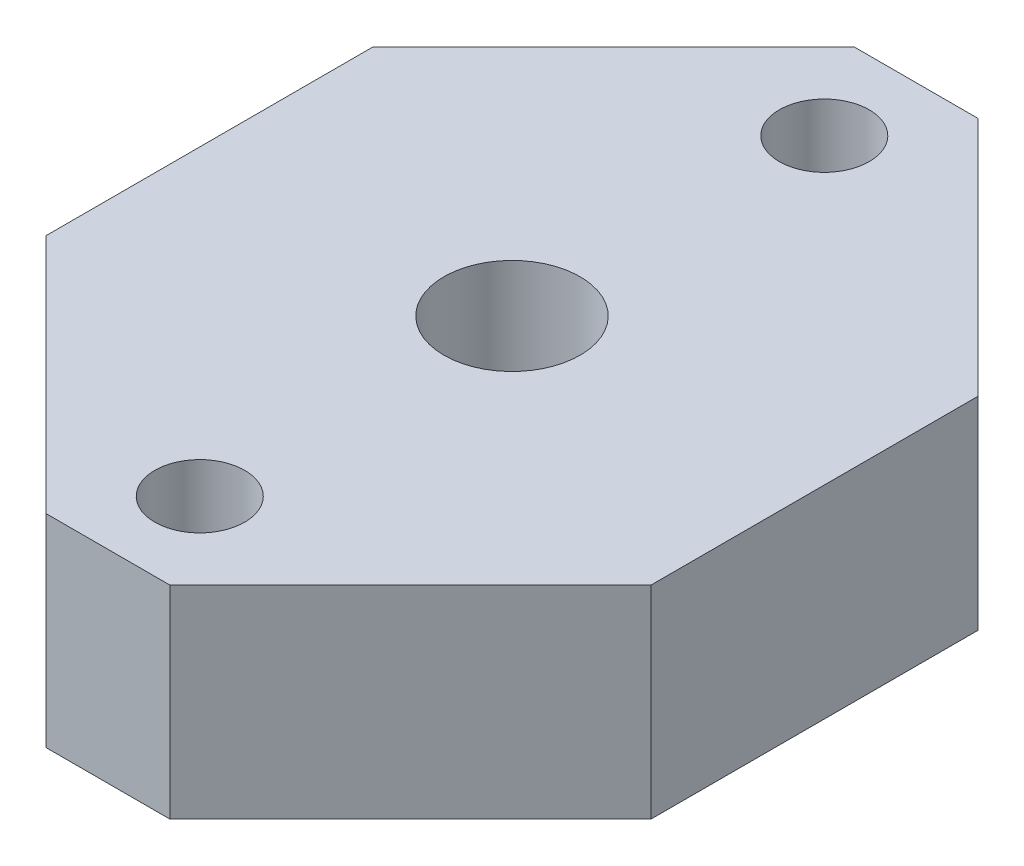
ISO-10303-21;
HEADER;
FILE_DESCRIPTION(('STEP AP214'),'2;1');
FILE_NAME('part.step','',(''),(''),'','','');
FILE_SCHEMA(('AUTOMOTIVE_DESIGN { 1 0 10303 214 1 1 1 1 }'));
ENDSEC;
DATA;
#1=APPLICATION_CONTEXT('core data for automotive mechanical design processes');
#2=APPLICATION_PROTOCOL_DEFINITION('international standard','automotive_design',2000,#1);
#3=PRODUCT_CONTEXT('',#1,'mechanical');
#4=PRODUCT('Part','Part','',(#3));
#5=PRODUCT_RELATED_PRODUCT_CATEGORY('part','',(#4));
#6=PRODUCT_DEFINITION_FORMATION('','',#4);
#7=PRODUCT_DEFINITION_CONTEXT('part definition',#1,'design');
#8=PRODUCT_DEFINITION('design','',#6,#7);
#9=PRODUCT_DEFINITION_SHAPE('','',#8);
#10=(LENGTH_UNIT() NAMED_UNIT(*) SI_UNIT(.MILLI.,.METRE.));
#11=(NAMED_UNIT(*) PLANE_ANGLE_UNIT() SI_UNIT($,.RADIAN.));
#12=(NAMED_UNIT(*) SI_UNIT($,.STERADIAN.) SOLID_ANGLE_UNIT());
#13=UNCERTAINTY_MEASURE_WITH_UNIT(LENGTH_MEASURE(1.E-05),#10,'distance_accuracy_value','');
#14=(GEOMETRIC_REPRESENTATION_CONTEXT(3) GLOBAL_UNCERTAINTY_ASSIGNED_CONTEXT((#13)) GLOBAL_UNIT_ASSIGNED_CONTEXT((#10,
#11,#12)) REPRESENTATION_CONTEXT('',''));
#15=CARTESIAN_POINT('',(0.,0.,0.));
#16=DIRECTION('',(0.,0.,1.));
#17=DIRECTION('',(1.,0.,0.));
#18=AXIS2_PLACEMENT_3D('',#15,#16,#17);
#19=CARTESIAN_POINT('',(0.,11.9126,0.));
#20=DIRECTION('',(0.,1.,0.));
#21=DIRECTION('',(0.,0.,1.));
#22=AXIS2_PLACEMENT_3D('',#19,#20,#21);
#23=PLANE('',#22);
#24=DIRECTION('',(0.707106781186548,0.,-0.707106781186548));
#25=VECTOR('',#24,1.);
#26=CARTESIAN_POINT('',(14.1421356237309,11.9126,-47.498));
#27=LINE('',#26,#25);
#28=CARTESIAN_POINT('',(0.,11.9126,-33.3558643762691));
#29=VERTEX_POINT('',#28);
#30=CARTESIAN_POINT('',(14.1421356237309,11.9126,-47.498));
#31=VERTEX_POINT('',#30);
#32=EDGE_CURVE('E165',#29,#31,#27,.T.);
#33=ORIENTED_EDGE('',*,*,#32,.F.);
#34=DIRECTION('',(0.,0.,1.));
#35=VECTOR('',#34,1.);
#36=CARTESIAN_POINT('',(0.,11.9126,-47.498));
#37=LINE('',#36,#35);
#38=CARTESIAN_POINT('',(0.,11.9126,-14.1421356237309));
#39=VERTEX_POINT('',#38);
#40=EDGE_CURVE('E132',#29,#39,#37,.T.);
#41=ORIENTED_EDGE('',*,*,#40,.T.);
#42=DIRECTION('',(-0.707106781186548,0.,-0.707106781186548));
#43=VECTOR('',#42,1.);
#44=CARTESIAN_POINT('',(14.1421356237309,11.9126,0.));
#45=LINE('',#44,#43);
#46=CARTESIAN_POINT('',(14.1421356237309,11.9126,0.));
#47=VERTEX_POINT('',#46);
#48=EDGE_CURVE('E106',#47,#39,#45,.T.);
#49=ORIENTED_EDGE('',*,*,#48,.F.);
#50=DIRECTION('',(1.,0.,0.));
#51=VECTOR('',#50,1.);
#52=CARTESIAN_POINT('',(0.,11.9126,0.));
#53=LINE('',#52,#51);
#54=CARTESIAN_POINT('',(21.4178643762691,11.9126,0.));
#55=VERTEX_POINT('',#54);
#56=EDGE_CURVE('E130',#47,#55,#53,.T.);
#57=ORIENTED_EDGE('',*,*,#56,.T.);
#58=DIRECTION('',(-0.707106781186547,0.,0.707106781186548));
#59=VECTOR('',#58,1.);
#60=CARTESIAN_POINT('',(21.4178643762691,11.9126,0.));
#61=LINE('',#60,#59);
#62=CARTESIAN_POINT('',(35.56,11.9126,-14.1421356237309));
#63=VERTEX_POINT('',#62);
#64=EDGE_CURVE('E101',#63,#55,#61,.T.);
#65=ORIENTED_EDGE('',*,*,#64,.F.);
#66=DIRECTION('',(0.,0.,-1.));
#67=VECTOR('',#66,1.);
#68=CARTESIAN_POINT('',(35.56,11.9126,-47.498));
#69=LINE('',#68,#67);
#70=CARTESIAN_POINT('',(35.56,11.9126,-33.3558643762691));
#71=VERTEX_POINT('',#70);
#72=EDGE_CURVE('E42',#63,#71,#69,.T.);
#73=ORIENTED_EDGE('',*,*,#72,.T.);
#74=DIRECTION('',(0.707106781186547,0.,0.707106781186548));
#75=VECTOR('',#74,1.);
#76=CARTESIAN_POINT('',(35.56,11.9126,-33.3558643762691));
#77=LINE('',#76,#75);
#78=CARTESIAN_POINT('',(21.4178643762691,11.9126,-47.498));
#79=VERTEX_POINT('',#78);
#80=EDGE_CURVE('E164',#79,#71,#77,.T.);
#81=ORIENTED_EDGE('',*,*,#80,.F.);
#82=DIRECTION('',(-1.,0.,0.));
#83=VECTOR('',#82,1.);
#84=CARTESIAN_POINT('',(0.,11.9126,-47.498));
#85=LINE('',#84,#83);
#86=EDGE_CURVE('E11',#79,#31,#85,.T.);
#87=ORIENTED_EDGE('',*,*,#86,.T.);
#88=EDGE_LOOP('',(#33,#41,#49,#57,#65,#73,#81,#87));
#89=FACE_BOUND('',#88,.T.);
#90=CARTESIAN_POINT('',(17.78,11.9126,-5.3975));
#91=DIRECTION('',(0.,1.,0.));
#92=DIRECTION('',(0.,0.,1.));
#93=AXIS2_PLACEMENT_3D('',#90,#91,#92);
#94=CIRCLE('',#93,2.6416);
#95=CARTESIAN_POINT('',(17.78,11.9126,-2.7559));
#96=VERTEX_POINT('',#95);
#97=EDGE_CURVE('E138',#96,#96,#94,.T.);
#98=ORIENTED_EDGE('',*,*,#97,.F.);
#99=EDGE_LOOP('',(#98));
#100=FACE_BOUND('',#99,.T.);
#101=CARTESIAN_POINT('',(17.78,11.9126,-42.1005));
#102=DIRECTION('',(0.,1.,0.));
#103=DIRECTION('',(0.,0.,1.));
#104=AXIS2_PLACEMENT_3D('',#101,#102,#103);
#105=CIRCLE('',#104,2.6416);
#106=CARTESIAN_POINT('',(17.78,11.9126,-39.4589));
#107=VERTEX_POINT('',#106);
#108=EDGE_CURVE('E125',#107,#107,#105,.T.);
#109=ORIENTED_EDGE('',*,*,#108,.F.);
#110=EDGE_LOOP('',(#109));
#111=FACE_BOUND('',#110,.T.);
#112=CARTESIAN_POINT('',(17.78,11.9126,-23.749));
#113=DIRECTION('',(0.,1.,0.));
#114=DIRECTION('',(0.,0.,1.));
#115=AXIS2_PLACEMENT_3D('',#112,#113,#114);
#116=CIRCLE('',#115,4.);
#117=CARTESIAN_POINT('',(17.78,11.9126,-19.749));
#118=VERTEX_POINT('',#117);
#119=EDGE_CURVE('E144',#118,#118,#116,.T.);
#120=ORIENTED_EDGE('',*,*,#119,.F.);
#121=EDGE_LOOP('',(#120));
#122=FACE_BOUND('',#121,.T.);
#123=ADVANCED_FACE('F33',(#89,#100,#111,#122),#23,.T.);
#124=CARTESIAN_POINT('',(0.,0.,0.));
#125=DIRECTION('',(0.,1.,0.));
#126=DIRECTION('',(0.,0.,1.));
#127=AXIS2_PLACEMENT_3D('',#124,#125,#126);
#128=PLANE('',#127);
#129=DIRECTION('',(0.,0.,1.));
#130=VECTOR('',#129,1.);
#131=CARTESIAN_POINT('',(0.,0.,-47.498));
#132=LINE('',#131,#130);
#133=CARTESIAN_POINT('',(0.,0.,-33.3558643762691));
#134=VERTEX_POINT('',#133);
#135=CARTESIAN_POINT('',(0.,0.,-14.1421356237309));
#136=VERTEX_POINT('',#135);
#137=EDGE_CURVE('E122',#134,#136,#132,.T.);
#138=ORIENTED_EDGE('',*,*,#137,.F.);
#139=DIRECTION('',(0.707106781186548,0.,-0.707106781186548));
#140=VECTOR('',#139,1.);
#141=CARTESIAN_POINT('',(14.1421356237309,0.,-47.498));
#142=LINE('',#141,#140);
#143=CARTESIAN_POINT('',(14.1421356237309,0.,-47.498));
#144=VERTEX_POINT('',#143);
#145=EDGE_CURVE('E161',#134,#144,#142,.T.);
#146=ORIENTED_EDGE('',*,*,#145,.T.);
#147=DIRECTION('',(-1.,0.,0.));
#148=VECTOR('',#147,1.);
#149=CARTESIAN_POINT('',(0.,0.,-47.498));
#150=LINE('',#149,#148);
#151=CARTESIAN_POINT('',(21.417864376269,0.,-47.498));
#152=VERTEX_POINT('',#151);
#153=EDGE_CURVE('E37',#152,#144,#150,.T.);
#154=ORIENTED_EDGE('',*,*,#153,.F.);
#155=DIRECTION('',(0.707106781186547,0.,0.707106781186548));
#156=VECTOR('',#155,1.);
#157=CARTESIAN_POINT('',(35.56,0.,-33.3558643762691));
#158=LINE('',#157,#156);
#159=CARTESIAN_POINT('',(35.56,0.,-33.3558643762691));
#160=VERTEX_POINT('',#159);
#161=EDGE_CURVE('E173',#152,#160,#158,.T.);
#162=ORIENTED_EDGE('',*,*,#161,.T.);
#163=DIRECTION('',(0.,0.,-1.));
#164=VECTOR('',#163,1.);
#165=CARTESIAN_POINT('',(35.56,0.,-47.498));
#166=LINE('',#165,#164);
#167=CARTESIAN_POINT('',(35.56,0.,-14.1421356237309));
#168=VERTEX_POINT('',#167);
#169=EDGE_CURVE('E118',#168,#160,#166,.T.);
#170=ORIENTED_EDGE('',*,*,#169,.F.);
#171=DIRECTION('',(-0.707106781186547,0.,0.707106781186548));
#172=VECTOR('',#171,1.);
#173=CARTESIAN_POINT('',(21.4178643762691,0.,0.));
#174=LINE('',#173,#172);
#175=CARTESIAN_POINT('',(21.4178643762691,0.,0.));
#176=VERTEX_POINT('',#175);
#177=EDGE_CURVE('E58',#168,#176,#174,.T.);
#178=ORIENTED_EDGE('',*,*,#177,.T.);
#179=DIRECTION('',(1.,0.,0.));
#180=VECTOR('',#179,1.);
#181=CARTESIAN_POINT('',(0.,0.,0.));
#182=LINE('',#181,#180);
#183=CARTESIAN_POINT('',(14.1421356237309,0.,0.));
#184=VERTEX_POINT('',#183);
#185=EDGE_CURVE('E115',#184,#176,#182,.T.);
#186=ORIENTED_EDGE('',*,*,#185,.F.);
#187=DIRECTION('',(-0.707106781186548,0.,-0.707106781186548));
#188=VECTOR('',#187,1.);
#189=CARTESIAN_POINT('',(14.1421356237309,0.,0.));
#190=LINE('',#189,#188);
#191=EDGE_CURVE('E50',#184,#136,#190,.T.);
#192=ORIENTED_EDGE('',*,*,#191,.T.);
#193=EDGE_LOOP('',(#138,#146,#154,#162,#170,#178,#186,#192));
#194=FACE_BOUND('',#193,.T.);
#195=CARTESIAN_POINT('',(17.78,0.,-42.1005));
#196=DIRECTION('',(0.,1.,0.));
#197=DIRECTION('',(0.,0.,1.));
#198=AXIS2_PLACEMENT_3D('',#195,#196,#197);
#199=CIRCLE('',#198,2.6416);
#200=CARTESIAN_POINT('',(17.78,0.,-39.4589));
#201=VERTEX_POINT('',#200);
#202=EDGE_CURVE('E135',#201,#201,#199,.T.);
#203=ORIENTED_EDGE('',*,*,#202,.T.);
#204=EDGE_LOOP('',(#203));
#205=FACE_BOUND('',#204,.T.);
#206=CARTESIAN_POINT('',(17.78,0.,-5.3975));
#207=DIRECTION('',(0.,1.,0.));
#208=DIRECTION('',(0.,0.,1.));
#209=AXIS2_PLACEMENT_3D('',#206,#207,#208);
#210=CIRCLE('',#209,2.6416);
#211=CARTESIAN_POINT('',(17.78,0.,-2.7559));
#212=VERTEX_POINT('',#211);
#213=EDGE_CURVE('E141',#212,#212,#210,.T.);
#214=ORIENTED_EDGE('',*,*,#213,.T.);
#215=EDGE_LOOP('',(#214));
#216=FACE_BOUND('',#215,.T.);
#217=CARTESIAN_POINT('',(17.78,0.,-23.749));
#218=DIRECTION('',(0.,1.,0.));
#219=DIRECTION('',(0.,0.,1.));
#220=AXIS2_PLACEMENT_3D('',#217,#218,#219);
#221=CIRCLE('',#220,4.);
#222=CARTESIAN_POINT('',(17.78,0.,-19.749));
#223=VERTEX_POINT('',#222);
#224=EDGE_CURVE('E147',#223,#223,#221,.T.);
#225=ORIENTED_EDGE('',*,*,#224,.T.);
#226=EDGE_LOOP('',(#225));
#227=FACE_BOUND('',#226,.T.);
#228=ADVANCED_FACE('F113',(#194,#205,#216,#227),#128,.F.);
#229=CARTESIAN_POINT('',(0.,11.9126,-47.498));
#230=DIRECTION('',(1.,0.,0.));
#231=DIRECTION('',(0.,0.,-1.));
#232=AXIS2_PLACEMENT_3D('',#229,#230,#231);
#233=PLANE('',#232);
#234=ORIENTED_EDGE('',*,*,#40,.F.);
#235=DIRECTION('',(0.,1.,0.));
#236=VECTOR('',#235,1.);
#237=CARTESIAN_POINT('',(0.,0.,-33.3558643762691));
#238=LINE('',#237,#236);
#239=EDGE_CURVE('E158',#134,#29,#238,.T.);
#240=ORIENTED_EDGE('',*,*,#239,.F.);
#241=ORIENTED_EDGE('',*,*,#137,.T.);
#242=DIRECTION('',(0.,1.,0.));
#243=VECTOR('',#242,1.);
#244=CARTESIAN_POINT('',(0.,0.,-14.1421356237309));
#245=LINE('',#244,#243);
#246=EDGE_CURVE('E150',#136,#39,#245,.T.);
#247=ORIENTED_EDGE('',*,*,#246,.T.);
#248=EDGE_LOOP('',(#234,#240,#241,#247));
#249=FACE_BOUND('',#248,.T.);
#250=ADVANCED_FACE('F35',(#249),#233,.F.);
#251=CARTESIAN_POINT('',(0.,11.9126,0.));
#252=DIRECTION('',(0.,0.,-1.));
#253=DIRECTION('',(-1.,0.,0.));
#254=AXIS2_PLACEMENT_3D('',#251,#252,#253);
#255=PLANE('',#254);
#256=ORIENTED_EDGE('',*,*,#185,.T.);
#257=DIRECTION('',(0.,1.,0.));
#258=VECTOR('',#257,1.);
#259=CARTESIAN_POINT('',(21.4178643762691,0.,0.));
#260=LINE('',#259,#258);
#261=EDGE_CURVE('E98',#176,#55,#260,.T.);
#262=ORIENTED_EDGE('',*,*,#261,.T.);
#263=ORIENTED_EDGE('',*,*,#56,.F.);
#264=DIRECTION('',(0.,1.,0.));
#265=VECTOR('',#264,1.);
#266=CARTESIAN_POINT('',(14.1421356237309,0.,0.));
#267=LINE('',#266,#265);
#268=EDGE_CURVE('E121',#184,#47,#267,.T.);
#269=ORIENTED_EDGE('',*,*,#268,.F.);
#270=EDGE_LOOP('',(#256,#262,#263,#269));
#271=FACE_BOUND('',#270,.T.);
#272=ADVANCED_FACE('F120',(#271),#255,.F.);
#273=CARTESIAN_POINT('',(35.56,11.9126,-47.498));
#274=DIRECTION('',(-1.,0.,0.));
#275=DIRECTION('',(0.,0.,1.));
#276=AXIS2_PLACEMENT_3D('',#273,#274,#275);
#277=PLANE('',#276);
#278=ORIENTED_EDGE('',*,*,#169,.T.);
#279=DIRECTION('',(0.,1.,0.));
#280=VECTOR('',#279,1.);
#281=CARTESIAN_POINT('',(35.56,0.,-33.3558643762691));
#282=LINE('',#281,#280);
#283=EDGE_CURVE('E169',#160,#71,#282,.T.);
#284=ORIENTED_EDGE('',*,*,#283,.T.);
#285=ORIENTED_EDGE('',*,*,#72,.F.);
#286=DIRECTION('',(0.,1.,0.));
#287=VECTOR('',#286,1.);
#288=CARTESIAN_POINT('',(35.56,0.,-14.1421356237309));
#289=LINE('',#288,#287);
#290=EDGE_CURVE('E107',#168,#63,#289,.T.);
#291=ORIENTED_EDGE('',*,*,#290,.F.);
#292=EDGE_LOOP('',(#278,#284,#285,#291));
#293=FACE_BOUND('',#292,.T.);
#294=ADVANCED_FACE('F185',(#293),#277,.F.);
#295=CARTESIAN_POINT('',(0.,11.9126,-47.498));
#296=DIRECTION('',(0.,0.,1.));
#297=DIRECTION('',(1.,0.,0.));
#298=AXIS2_PLACEMENT_3D('',#295,#296,#297);
#299=PLANE('',#298);
#300=ORIENTED_EDGE('',*,*,#153,.T.);
#301=DIRECTION('',(0.,1.,0.));
#302=VECTOR('',#301,1.);
#303=CARTESIAN_POINT('',(14.1421356237309,0.,-47.498));
#304=LINE('',#303,#302);
#305=EDGE_CURVE('E160',#144,#31,#304,.T.);
#306=ORIENTED_EDGE('',*,*,#305,.T.);
#307=ORIENTED_EDGE('',*,*,#86,.F.);
#308=DIRECTION('',(0.,1.,0.));
#309=VECTOR('',#308,1.);
#310=CARTESIAN_POINT('',(21.4178643762691,0.,-47.498));
#311=LINE('',#310,#309);
#312=EDGE_CURVE('E172',#152,#79,#311,.T.);
#313=ORIENTED_EDGE('',*,*,#312,.F.);
#314=EDGE_LOOP('',(#300,#306,#307,#313));
#315=FACE_BOUND('',#314,.T.);
#316=ADVANCED_FACE('F192',(#315),#299,.F.);
#317=CARTESIAN_POINT('',(17.78,11.9126,-42.1005));
#318=DIRECTION('',(0.,-1.,0.));
#319=DIRECTION('',(0.,0.,-1.));
#320=AXIS2_PLACEMENT_3D('',#317,#318,#319);
#321=CYLINDRICAL_SURFACE('',#320,2.6416);
#322=ORIENTED_EDGE('',*,*,#108,.T.);
#323=EDGE_LOOP('',(#322));
#324=FACE_BOUND('',#323,.T.);
#325=ORIENTED_EDGE('',*,*,#202,.F.);
#326=EDGE_LOOP('',(#325));
#327=FACE_BOUND('',#326,.T.);
#328=ADVANCED_FACE('F215',(#324,#327),#321,.F.);
#329=CARTESIAN_POINT('',(17.78,11.9126,-5.3975));
#330=DIRECTION('',(0.,-1.,0.));
#331=DIRECTION('',(0.,0.,-1.));
#332=AXIS2_PLACEMENT_3D('',#329,#330,#331);
#333=CYLINDRICAL_SURFACE('',#332,2.6416);
#334=ORIENTED_EDGE('',*,*,#97,.T.);
#335=EDGE_LOOP('',(#334));
#336=FACE_BOUND('',#335,.T.);
#337=ORIENTED_EDGE('',*,*,#213,.F.);
#338=EDGE_LOOP('',(#337));
#339=FACE_BOUND('',#338,.T.);
#340=ADVANCED_FACE('F245',(#336,#339),#333,.F.);
#341=CARTESIAN_POINT('',(17.78,11.9126,-23.749));
#342=DIRECTION('',(0.,-1.,0.));
#343=DIRECTION('',(0.,0.,-1.));
#344=AXIS2_PLACEMENT_3D('',#341,#342,#343);
#345=CYLINDRICAL_SURFACE('',#344,4.);
#346=ORIENTED_EDGE('',*,*,#119,.T.);
#347=EDGE_LOOP('',(#346));
#348=FACE_BOUND('',#347,.T.);
#349=ORIENTED_EDGE('',*,*,#224,.F.);
#350=EDGE_LOOP('',(#349));
#351=FACE_BOUND('',#350,.T.);
#352=ADVANCED_FACE('F240',(#348,#351),#345,.F.);
#353=CARTESIAN_POINT('',(35.56,0.,-33.3558643762691));
#354=DIRECTION('',(-0.707106781186548,0.,0.707106781186547));
#355=DIRECTION('',(0.707106781186547,0.,0.707106781186548));
#356=AXIS2_PLACEMENT_3D('',#353,#354,#355);
#357=PLANE('',#356);
#358=ORIENTED_EDGE('',*,*,#80,.T.);
#359=ORIENTED_EDGE('',*,*,#283,.F.);
#360=ORIENTED_EDGE('',*,*,#161,.F.);
#361=ORIENTED_EDGE('',*,*,#312,.T.);
#362=EDGE_LOOP('',(#358,#359,#360,#361));
#363=FACE_BOUND('',#362,.T.);
#364=ADVANCED_FACE('F187',(#363),#357,.F.);
#365=CARTESIAN_POINT('',(14.1421356237309,0.,-47.498));
#366=DIRECTION('',(0.707106781186548,0.,0.707106781186548));
#367=DIRECTION('',(0.707106781186548,0.,-0.707106781186548));
#368=AXIS2_PLACEMENT_3D('',#365,#366,#367);
#369=PLANE('',#368);
#370=ORIENTED_EDGE('',*,*,#32,.T.);
#371=ORIENTED_EDGE('',*,*,#305,.F.);
#372=ORIENTED_EDGE('',*,*,#145,.F.);
#373=ORIENTED_EDGE('',*,*,#239,.T.);
#374=EDGE_LOOP('',(#370,#371,#372,#373));
#375=FACE_BOUND('',#374,.T.);
#376=ADVANCED_FACE('F204',(#375),#369,.F.);
#377=CARTESIAN_POINT('',(21.4178643762691,0.,0.));
#378=DIRECTION('',(-0.707106781186548,0.,-0.707106781186547));
#379=DIRECTION('',(-0.707106781186547,0.,0.707106781186548));
#380=AXIS2_PLACEMENT_3D('',#377,#378,#379);
#381=PLANE('',#380);
#382=ORIENTED_EDGE('',*,*,#64,.T.);
#383=ORIENTED_EDGE('',*,*,#261,.F.);
#384=ORIENTED_EDGE('',*,*,#177,.F.);
#385=ORIENTED_EDGE('',*,*,#290,.T.);
#386=EDGE_LOOP('',(#382,#383,#384,#385));
#387=FACE_BOUND('',#386,.T.);
#388=ADVANCED_FACE('F99',(#387),#381,.F.);
#389=CARTESIAN_POINT('',(14.1421356237309,0.,0.));
#390=DIRECTION('',(0.707106781186548,0.,-0.707106781186548));
#391=DIRECTION('',(-0.707106781186548,0.,-0.707106781186548));
#392=AXIS2_PLACEMENT_3D('',#389,#390,#391);
#393=PLANE('',#392);
#394=ORIENTED_EDGE('',*,*,#48,.T.);
#395=ORIENTED_EDGE('',*,*,#246,.F.);
#396=ORIENTED_EDGE('',*,*,#191,.F.);
#397=ORIENTED_EDGE('',*,*,#268,.T.);
#398=EDGE_LOOP('',(#394,#395,#396,#397));
#399=FACE_BOUND('',#398,.T.);
#400=ADVANCED_FACE('F198',(#399),#393,.F.);
#401=CLOSED_SHELL('',(#123,#228,#250,#272,#294,#316,#328,#340,#352,#364,#376,#388,#400));
#402=MANIFOLD_SOLID_BREP('B2',#401);
#403=ADVANCED_BREP_SHAPE_REPRESENTATION('',(#18,#402),#14);
#404=SHAPE_DEFINITION_REPRESENTATION(#9,#403);
ENDSEC;
END-ISO-10303-21;
